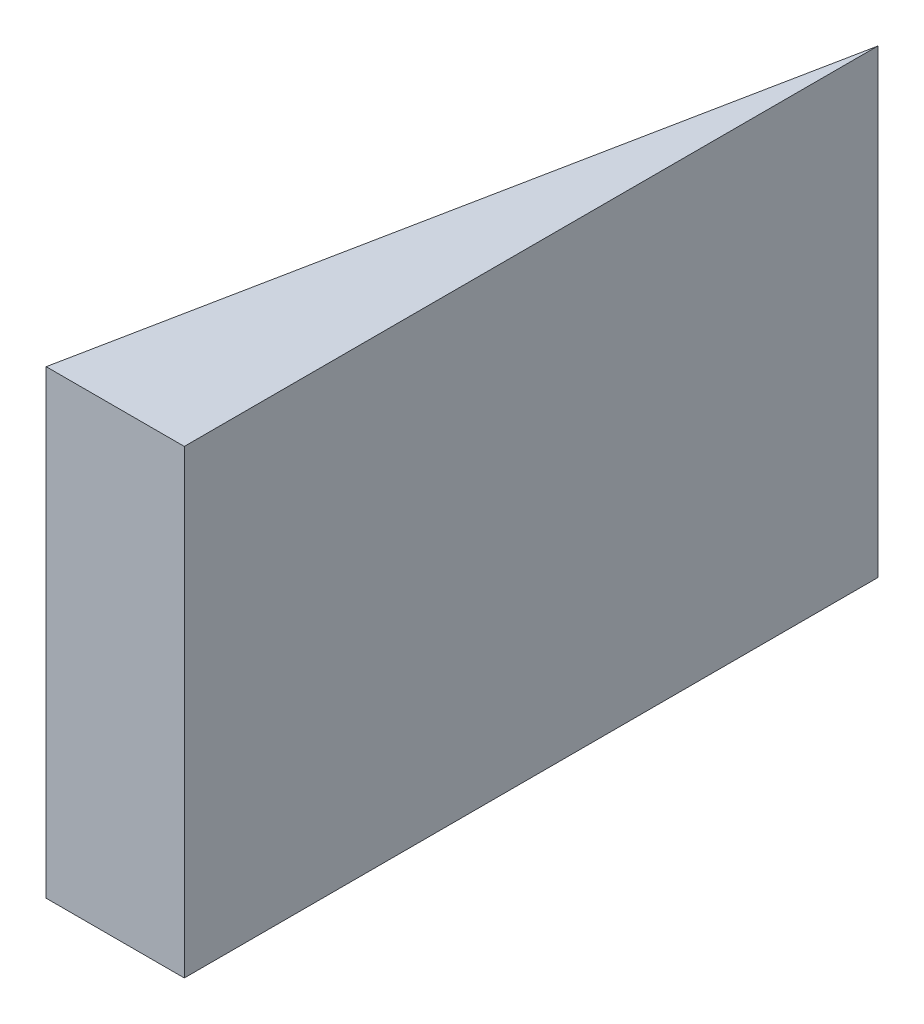
ISO-10303-21;
HEADER;
FILE_DESCRIPTION(('STEP AP214'),'2;1');
FILE_NAME('part.step','',(''),(''),'','','');
FILE_SCHEMA(('AUTOMOTIVE_DESIGN { 1 0 10303 214 1 1 1 1 }'));
ENDSEC;
DATA;
#1=APPLICATION_CONTEXT('core data for automotive mechanical design processes');
#2=APPLICATION_PROTOCOL_DEFINITION('international standard','automotive_design',2000,#1);
#3=PRODUCT_CONTEXT('',#1,'mechanical');
#4=PRODUCT('Part','Part','',(#3));
#5=PRODUCT_RELATED_PRODUCT_CATEGORY('part','',(#4));
#6=PRODUCT_DEFINITION_FORMATION('','',#4);
#7=PRODUCT_DEFINITION_CONTEXT('part definition',#1,'design');
#8=PRODUCT_DEFINITION('design','',#6,#7);
#9=PRODUCT_DEFINITION_SHAPE('','',#8);
#10=(LENGTH_UNIT() NAMED_UNIT(*) SI_UNIT(.MILLI.,.METRE.));
#11=(NAMED_UNIT(*) PLANE_ANGLE_UNIT() SI_UNIT($,.RADIAN.));
#12=(NAMED_UNIT(*) SI_UNIT($,.STERADIAN.) SOLID_ANGLE_UNIT());
#13=UNCERTAINTY_MEASURE_WITH_UNIT(LENGTH_MEASURE(1.E-05),#10,'distance_accuracy_value','');
#14=(GEOMETRIC_REPRESENTATION_CONTEXT(3) GLOBAL_UNCERTAINTY_ASSIGNED_CONTEXT((#13)) GLOBAL_UNIT_ASSIGNED_CONTEXT((#10,
#11,#12)) REPRESENTATION_CONTEXT('',''));
#15=CARTESIAN_POINT('',(0.,0.,0.));
#16=DIRECTION('',(0.,0.,1.));
#17=DIRECTION('',(1.,0.,0.));
#18=AXIS2_PLACEMENT_3D('',#15,#16,#17);
#19=CARTESIAN_POINT('',(-3.37532140033028,1.75000063546533,-5.23287750649398));
#20=DIRECTION('',(-1.74845553146952E-07,-1.,8.74227765734759E-08));
#21=DIRECTION('',(1.,-1.74845553146952E-07,0.));
#22=AXIS2_PLACEMENT_3D('',#19,#20,#21);
#23=PLANE('',#22);
#24=DIRECTION('',(-0.999999999999985,1.7484555285089E-07,0.));
#25=VECTOR('',#24,1.);
#26=CARTESIAN_POINT('',(-2.99999969402027,1.75000070812349,-3.65112167398598));
#27=LINE('',#26,#25);
#28=CARTESIAN_POINT('',(-2.99999969402027,1.75000070812249,-3.65112167398598));
#29=VERTEX_POINT('',#28);
#30=CARTESIAN_POINT('',(-3.29999969402027,1.75000076057616,-3.65112167398698));
#31=VERTEX_POINT('',#30);
#32=EDGE_CURVE('E11',#29,#31,#27,.T.);
#33=ORIENTED_EDGE('',*,*,#32,.F.);
#34=DIRECTION('',(0.,8.74227765663743E-08,0.999999999999996));
#35=VECTOR('',#34,1.);
#36=CARTESIAN_POINT('',(-2.99999969402028,1.75000057642684,-5.15755580018398));
#37=LINE('',#36,#35);
#38=CARTESIAN_POINT('',(-2.99999969402028,1.75000057642584,-5.15755580018298));
#39=VERTEX_POINT('',#38);
#40=EDGE_CURVE('E63',#39,#29,#37,.T.);
#41=ORIENTED_EDGE('',*,*,#40,.F.);
#42=DIRECTION('',(0.195310522456611,-1.19888317288917E-07,-0.980741454114035));
#43=VECTOR('',#42,1.);
#44=CARTESIAN_POINT('',(-3.29999969402027,1.75000076057716,-3.65112167398598));
#45=LINE('',#44,#43);
#46=EDGE_CURVE('E70',#31,#39,#45,.T.);
#47=ORIENTED_EDGE('',*,*,#46,.F.);
#48=EDGE_LOOP('',(#33,#41,#47));
#49=FACE_BOUND('',#48,.T.);
#50=ADVANCED_FACE('F17',(#49),#23,.F.);
#51=CARTESIAN_POINT('',(-3.37532157517583,0.750000635465335,-5.2328774190712));
#52=DIRECTION('',(-1.74845553146952E-07,-1.,8.74227765734759E-08));
#53=DIRECTION('',(1.,-1.74845553146952E-07,0.));
#54=AXIS2_PLACEMENT_3D('',#51,#52,#53);
#55=PLANE('',#54);
#56=DIRECTION('',(0.195310522456611,-1.19888317361196E-07,-0.980741454114035));
#57=VECTOR('',#56,1.);
#58=CARTESIAN_POINT('',(-3.29999986886582,0.750000760577156,-3.6511215865632));
#59=LINE('',#58,#57);
#60=CARTESIAN_POINT('',(-3.29999986886582,0.750000760578156,-3.6511215865642));
#61=VERTEX_POINT('',#60);
#62=CARTESIAN_POINT('',(-2.99999986886583,0.750000576427836,-5.1575557127602));
#63=VERTEX_POINT('',#62);
#64=EDGE_CURVE('E24',#61,#63,#59,.T.);
#65=ORIENTED_EDGE('',*,*,#64,.T.);
#66=DIRECTION('',(0.,8.74227765663743E-08,0.999999999999996));
#67=VECTOR('',#66,1.);
#68=CARTESIAN_POINT('',(-2.99999986886583,0.750000576426836,-5.1575557127612));
#69=LINE('',#68,#67);
#70=CARTESIAN_POINT('',(-2.99999986886582,0.75000070812449,-3.6511215865632));
#71=VERTEX_POINT('',#70);
#72=EDGE_CURVE('E49',#63,#71,#69,.T.);
#73=ORIENTED_EDGE('',*,*,#72,.T.);
#74=DIRECTION('',(-0.999999999999985,1.74845553220964E-07,0.));
#75=VECTOR('',#74,1.);
#76=CARTESIAN_POINT('',(-2.99999986886582,0.75000070812349,-3.6511215865632));
#77=LINE('',#76,#75);
#78=EDGE_CURVE('E46',#71,#61,#77,.T.);
#79=ORIENTED_EDGE('',*,*,#78,.T.);
#80=EDGE_LOOP('',(#65,#73,#79));
#81=FACE_BOUND('',#80,.T.);
#82=ADVANCED_FACE('F47',(#81),#55,.T.);
#83=CARTESIAN_POINT('',(-3.29999969402027,1.75000076057716,-3.65112167398598));
#84=DIRECTION('',(-0.980741454114042,1.5440369389369E-07,-0.195310522456627));
#85=DIRECTION('',(0.195310522456612,-1.19888317353705E-07,-0.980741454114039));
#86=AXIS2_PLACEMENT_3D('',#83,#84,#85);
#87=PLANE('',#86);
#88=ORIENTED_EDGE('',*,*,#46,.T.);
#89=DIRECTION('',(-1.74845553146948E-07,-0.999999999999981,8.74227756852958E-08));
#90=VECTOR('',#89,1.);
#91=CARTESIAN_POINT('',(-2.99999969402028,1.75000057642684,-5.15755580018398));
#92=LINE('',#91,#90);
#93=EDGE_CURVE('E54',#39,#63,#92,.T.);
#94=ORIENTED_EDGE('',*,*,#93,.T.);
#95=ORIENTED_EDGE('',*,*,#64,.F.);
#96=DIRECTION('',(-1.74845553146948E-07,-0.999999999999981,8.74227765734742E-08));
#97=VECTOR('',#96,1.);
#98=CARTESIAN_POINT('',(-3.29999969402027,1.75000076057716,-3.65112167398598));
#99=LINE('',#98,#97);
#100=EDGE_CURVE('E61',#31,#61,#99,.T.);
#101=ORIENTED_EDGE('',*,*,#100,.F.);
#102=EDGE_LOOP('',(#88,#94,#95,#101));
#103=FACE_BOUND('',#102,.T.);
#104=ADVANCED_FACE('F60',(#103),#87,.T.);
#105=CARTESIAN_POINT('',(-2.99999969402028,1.75000057642684,-5.15755580018398));
#106=DIRECTION('',(1.,-1.74845553146952E-07,0.));
#107=DIRECTION('',(0.,8.74227765734759E-08,1.));
#108=AXIS2_PLACEMENT_3D('',#105,#106,#107);
#109=PLANE('',#108);
#110=ORIENTED_EDGE('',*,*,#40,.T.);
#111=DIRECTION('',(-1.74845553146948E-07,-0.999999999999981,8.74227765734742E-08));
#112=VECTOR('',#111,1.);
#113=CARTESIAN_POINT('',(-2.99999969402027,1.75000070812349,-3.65112167398598));
#114=LINE('',#113,#112);
#115=EDGE_CURVE('E55',#29,#71,#114,.T.);
#116=ORIENTED_EDGE('',*,*,#115,.T.);
#117=ORIENTED_EDGE('',*,*,#72,.F.);
#118=ORIENTED_EDGE('',*,*,#93,.F.);
#119=EDGE_LOOP('',(#110,#116,#117,#118));
#120=FACE_BOUND('',#119,.T.);
#121=ADVANCED_FACE('F73',(#120),#109,.T.);
#122=CARTESIAN_POINT('',(-2.99999969402027,1.75000070812349,-3.65112167398598));
#123=DIRECTION('',(0.,8.74227765734759E-08,1.));
#124=DIRECTION('',(-1.,1.74845553146952E-07,0.));
#125=AXIS2_PLACEMENT_3D('',#122,#123,#124);
#126=PLANE('',#125);
#127=ORIENTED_EDGE('',*,*,#32,.T.);
#128=ORIENTED_EDGE('',*,*,#100,.T.);
#129=ORIENTED_EDGE('',*,*,#78,.F.);
#130=ORIENTED_EDGE('',*,*,#115,.F.);
#131=EDGE_LOOP('',(#127,#128,#129,#130));
#132=FACE_BOUND('',#131,.T.);
#133=ADVANCED_FACE('F64',(#132),#126,.T.);
#134=CLOSED_SHELL('',(#50,#82,#104,#121,#133));
#135=MANIFOLD_SOLID_BREP('B1',#134);
#136=ADVANCED_BREP_SHAPE_REPRESENTATION('',(#18,#135),#14);
#137=SHAPE_DEFINITION_REPRESENTATION(#9,#136);
ENDSEC;
END-ISO-10303-21;
